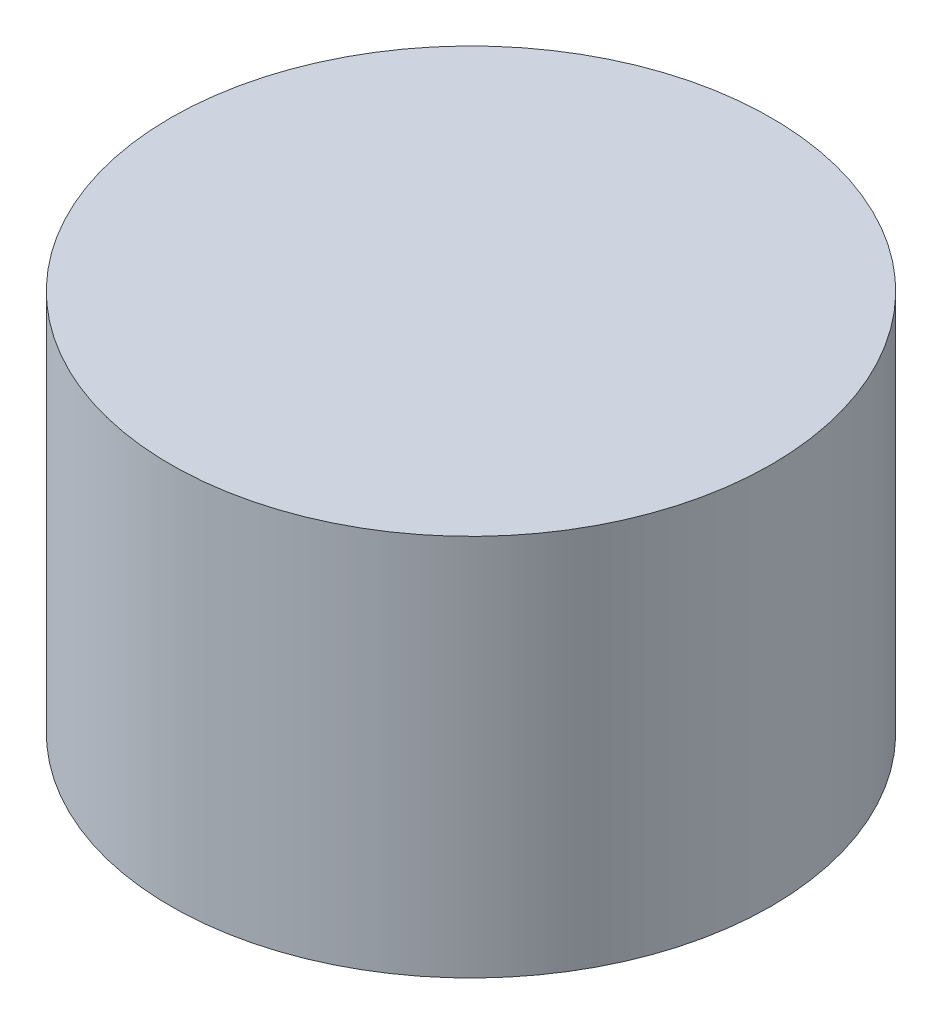
ISO-10303-21;
HEADER;
FILE_DESCRIPTION(('STEP AP214'),'2;1');
FILE_NAME('part.step','',(''),(''),'','','');
FILE_SCHEMA(('AUTOMOTIVE_DESIGN { 1 0 10303 214 1 1 1 1 }'));
ENDSEC;
DATA;
#1=APPLICATION_CONTEXT('core data for automotive mechanical design processes');
#2=APPLICATION_PROTOCOL_DEFINITION('international standard','automotive_design',2000,#1);
#3=PRODUCT_CONTEXT('',#1,'mechanical');
#4=PRODUCT('Part','Part','',(#3));
#5=PRODUCT_RELATED_PRODUCT_CATEGORY('part','',(#4));
#6=PRODUCT_DEFINITION_FORMATION('','',#4);
#7=PRODUCT_DEFINITION_CONTEXT('part definition',#1,'design');
#8=PRODUCT_DEFINITION('design','',#6,#7);
#9=PRODUCT_DEFINITION_SHAPE('','',#8);
#10=(LENGTH_UNIT() NAMED_UNIT(*) SI_UNIT(.MILLI.,.METRE.));
#11=(NAMED_UNIT(*) PLANE_ANGLE_UNIT() SI_UNIT($,.RADIAN.));
#12=(NAMED_UNIT(*) SI_UNIT($,.STERADIAN.) SOLID_ANGLE_UNIT());
#13=UNCERTAINTY_MEASURE_WITH_UNIT(LENGTH_MEASURE(1.E-05),#10,'distance_accuracy_value','');
#14=(GEOMETRIC_REPRESENTATION_CONTEXT(3) GLOBAL_UNCERTAINTY_ASSIGNED_CONTEXT((#13)) GLOBAL_UNIT_ASSIGNED_CONTEXT((#10,
#11,#12)) REPRESENTATION_CONTEXT('',''));
#15=CARTESIAN_POINT('',(0.,0.,0.));
#16=DIRECTION('',(0.,0.,1.));
#17=DIRECTION('',(1.,0.,0.));
#18=AXIS2_PLACEMENT_3D('',#15,#16,#17);
#19=CARTESIAN_POINT('',(29.0000002831221,154.,71.0000012069941));
#20=DIRECTION('',(0.,1.,0.));
#21=DIRECTION('',(1.,0.,0.));
#22=AXIS2_PLACEMENT_3D('',#19,#20,#21);
#23=PLANE('',#22);
#24=CARTESIAN_POINT('',(29.0000002831221,154.,71.0000012069941));
#25=DIRECTION('',(0.,1.,0.));
#26=DIRECTION('',(-1.,0.,0.));
#27=AXIS2_PLACEMENT_3D('',#24,#25,#26);
#28=CIRCLE('',#27,10.875);
#29=CARTESIAN_POINT('',(39.8750002831221,154.,71.0000012069941));
#30=VERTEX_POINT('',#29);
#31=EDGE_CURVE('E11',#30,#30,#28,.T.);
#32=ORIENTED_EDGE('',*,*,#31,.F.);
#33=EDGE_LOOP('',(#32));
#34=FACE_BOUND('',#33,.T.);
#35=ADVANCED_FACE('F17',(#34),#23,.F.);
#36=CARTESIAN_POINT('',(29.0000002831221,167.85,71.0000012069941));
#37=DIRECTION('',(0.,1.,0.));
#38=DIRECTION('',(1.,0.,0.));
#39=AXIS2_PLACEMENT_3D('',#36,#37,#38);
#40=PLANE('',#39);
#41=CARTESIAN_POINT('',(29.0000002831221,167.85,71.0000012069941));
#42=DIRECTION('',(0.,1.,0.));
#43=DIRECTION('',(-1.,0.,0.));
#44=AXIS2_PLACEMENT_3D('',#41,#42,#43);
#45=CIRCLE('',#44,10.875);
#46=CARTESIAN_POINT('',(39.8750002831221,167.85,71.0000012069941));
#47=VERTEX_POINT('',#46);
#48=EDGE_CURVE('E41',#47,#47,#45,.T.);
#49=ORIENTED_EDGE('',*,*,#48,.T.);
#50=EDGE_LOOP('',(#49));
#51=FACE_BOUND('',#50,.T.);
#52=ADVANCED_FACE('F45',(#51),#40,.T.);
#53=CARTESIAN_POINT('',(29.0000002831221,154.,71.0000012069941));
#54=DIRECTION('',(0.,1.,0.));
#55=DIRECTION('',(-1.,0.,0.));
#56=AXIS2_PLACEMENT_3D('',#53,#54,#55);
#57=CYLINDRICAL_SURFACE('',#56,10.875);
#58=ORIENTED_EDGE('',*,*,#48,.F.);
#59=DIRECTION('',(0.,-1.,0.));
#60=VECTOR('',#59,1.);
#61=CARTESIAN_POINT('',(39.8750002831221,154.,71.0000012069941));
#62=LINE('',#61,#60);
#63=EDGE_CURVE('E26',#47,#30,#62,.T.);
#64=ORIENTED_EDGE('',*,*,#63,.T.);
#65=ORIENTED_EDGE('',*,*,#31,.T.);
#66=ORIENTED_EDGE('',*,*,#63,.F.);
#67=EDGE_LOOP('',(#58,#64,#65,#66));
#68=FACE_BOUND('',#67,.T.);
#69=ADVANCED_FACE('F19',(#68),#57,.T.);
#70=CLOSED_SHELL('',(#35,#52,#69));
#71=MANIFOLD_SOLID_BREP('B1',#70);
#72=ADVANCED_BREP_SHAPE_REPRESENTATION('',(#18,#71),#14);
#73=SHAPE_DEFINITION_REPRESENTATION(#9,#72);
ENDSEC;
END-ISO-10303-21;
